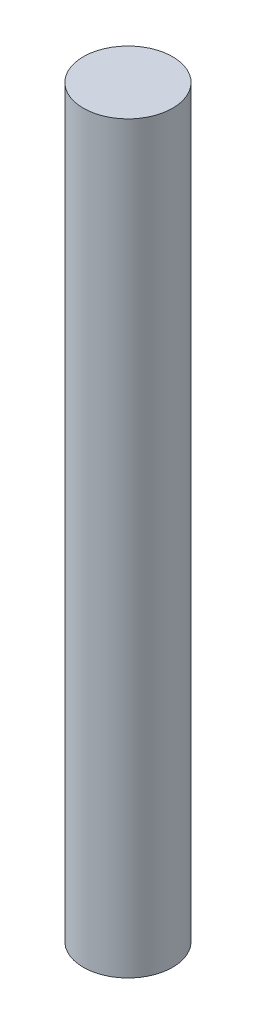
ISO-10303-21;
HEADER;
FILE_DESCRIPTION(('STEP AP214'),'2;1');
FILE_NAME('part.step','',(''),(''),'','','');
FILE_SCHEMA(('AUTOMOTIVE_DESIGN { 1 0 10303 214 1 1 1 1 }'));
ENDSEC;
DATA;
#1=APPLICATION_CONTEXT('core data for automotive mechanical design processes');
#2=APPLICATION_PROTOCOL_DEFINITION('international standard','automotive_design',2000,#1);
#3=PRODUCT_CONTEXT('',#1,'mechanical');
#4=PRODUCT('Part','Part','',(#3));
#5=PRODUCT_RELATED_PRODUCT_CATEGORY('part','',(#4));
#6=PRODUCT_DEFINITION_FORMATION('','',#4);
#7=PRODUCT_DEFINITION_CONTEXT('part definition',#1,'design');
#8=PRODUCT_DEFINITION('design','',#6,#7);
#9=PRODUCT_DEFINITION_SHAPE('','',#8);
#10=(LENGTH_UNIT() NAMED_UNIT(*) SI_UNIT(.MILLI.,.METRE.));
#11=(NAMED_UNIT(*) PLANE_ANGLE_UNIT() SI_UNIT($,.RADIAN.));
#12=(NAMED_UNIT(*) SI_UNIT($,.STERADIAN.) SOLID_ANGLE_UNIT());
#13=UNCERTAINTY_MEASURE_WITH_UNIT(LENGTH_MEASURE(1.E-05),#10,'distance_accuracy_value','');
#14=(GEOMETRIC_REPRESENTATION_CONTEXT(3) GLOBAL_UNCERTAINTY_ASSIGNED_CONTEXT((#13)) GLOBAL_UNIT_ASSIGNED_CONTEXT((#10,
#11,#12)) REPRESENTATION_CONTEXT('',''));
#15=CARTESIAN_POINT('',(0.,0.,0.));
#16=DIRECTION('',(0.,0.,1.));
#17=DIRECTION('',(1.,0.,0.));
#18=AXIS2_PLACEMENT_3D('',#15,#16,#17);
#19=CARTESIAN_POINT('',(0.,62.5,0.));
#20=DIRECTION('',(0.,-1.,0.));
#21=DIRECTION('',(0.,0.,-1.));
#22=AXIS2_PLACEMENT_3D('',#19,#20,#21);
#23=CYLINDRICAL_SURFACE('',#22,7.5);
#24=CARTESIAN_POINT('',(0.,62.5,0.));
#25=DIRECTION('',(0.,1.,0.));
#26=DIRECTION('',(0.,0.,1.));
#27=AXIS2_PLACEMENT_3D('',#24,#25,#26);
#28=CIRCLE('',#27,7.5);
#29=CARTESIAN_POINT('',(0.,62.5,7.5));
#30=VERTEX_POINT('',#29);
#31=EDGE_CURVE('E10',#30,#30,#28,.T.);
#32=ORIENTED_EDGE('',*,*,#31,.F.);
#33=EDGE_LOOP('',(#32));
#34=FACE_BOUND('',#33,.T.);
#35=CARTESIAN_POINT('',(0.,-62.5,0.));
#36=DIRECTION('',(0.,1.,0.));
#37=DIRECTION('',(0.,0.,1.));
#38=AXIS2_PLACEMENT_3D('',#35,#36,#37);
#39=CIRCLE('',#38,7.5);
#40=CARTESIAN_POINT('',(0.,-62.5,7.5));
#41=VERTEX_POINT('',#40);
#42=EDGE_CURVE('E34',#41,#41,#39,.T.);
#43=ORIENTED_EDGE('',*,*,#42,.T.);
#44=EDGE_LOOP('',(#43));
#45=FACE_BOUND('',#44,.T.);
#46=ADVANCED_FACE('F31',(#34,#45),#23,.T.);
#47=CARTESIAN_POINT('',(0.,62.5,0.));
#48=DIRECTION('',(0.,1.,0.));
#49=DIRECTION('',(0.,0.,1.));
#50=AXIS2_PLACEMENT_3D('',#47,#48,#49);
#51=PLANE('',#50);
#52=ORIENTED_EDGE('',*,*,#31,.T.);
#53=EDGE_LOOP('',(#52));
#54=FACE_BOUND('',#53,.T.);
#55=ADVANCED_FACE('F46',(#54),#51,.T.);
#56=CARTESIAN_POINT('',(0.,-62.5,0.));
#57=DIRECTION('',(0.,1.,0.));
#58=DIRECTION('',(0.,0.,1.));
#59=AXIS2_PLACEMENT_3D('',#56,#57,#58);
#60=PLANE('',#59);
#61=ORIENTED_EDGE('',*,*,#42,.F.);
#62=EDGE_LOOP('',(#61));
#63=FACE_BOUND('',#62,.T.);
#64=ADVANCED_FACE('F44',(#63),#60,.F.);
#65=CLOSED_SHELL('',(#46,#55,#64));
#66=MANIFOLD_SOLID_BREP('B2',#65);
#67=ADVANCED_BREP_SHAPE_REPRESENTATION('',(#18,#66),#14);
#68=SHAPE_DEFINITION_REPRESENTATION(#9,#67);
ENDSEC;
END-ISO-10303-21;
